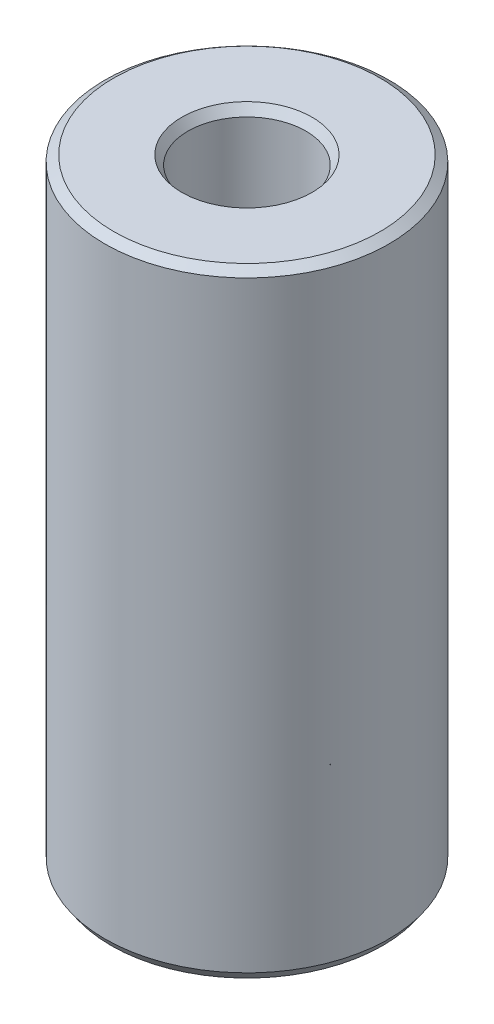
ISO-10303-21;
HEADER;
FILE_DESCRIPTION(('STEP AP214'),'2;1');
FILE_NAME('part.step','',(''),(''),'','','');
FILE_SCHEMA(('AUTOMOTIVE_DESIGN { 1 0 10303 214 1 1 1 1 }'));
ENDSEC;
DATA;
#1=APPLICATION_CONTEXT('core data for automotive mechanical design processes');
#2=APPLICATION_PROTOCOL_DEFINITION('international standard','automotive_design',2000,#1);
#3=PRODUCT_CONTEXT('',#1,'mechanical');
#4=PRODUCT('Part','Part','',(#3));
#5=PRODUCT_RELATED_PRODUCT_CATEGORY('part','',(#4));
#6=PRODUCT_DEFINITION_FORMATION('','',#4);
#7=PRODUCT_DEFINITION_CONTEXT('part definition',#1,'design');
#8=PRODUCT_DEFINITION('design','',#6,#7);
#9=PRODUCT_DEFINITION_SHAPE('','',#8);
#10=(LENGTH_UNIT() NAMED_UNIT(*) SI_UNIT(.MILLI.,.METRE.));
#11=(NAMED_UNIT(*) PLANE_ANGLE_UNIT() SI_UNIT($,.RADIAN.));
#12=(NAMED_UNIT(*) SI_UNIT($,.STERADIAN.) SOLID_ANGLE_UNIT());
#13=UNCERTAINTY_MEASURE_WITH_UNIT(LENGTH_MEASURE(1.E-05),#10,'distance_accuracy_value','');
#14=(GEOMETRIC_REPRESENTATION_CONTEXT(3) GLOBAL_UNCERTAINTY_ASSIGNED_CONTEXT((#13)) GLOBAL_UNIT_ASSIGNED_CONTEXT((#10,
#11,#12)) REPRESENTATION_CONTEXT('',''));
#15=CARTESIAN_POINT('',(0.,0.,0.));
#16=DIRECTION('',(0.,0.,1.));
#17=DIRECTION('',(1.,0.,0.));
#18=AXIS2_PLACEMENT_3D('',#15,#16,#17);
#19=CARTESIAN_POINT('',(0.,141.156435356315,0.));
#20=DIRECTION('',(0.,-1.,0.));
#21=DIRECTION('',(0.,0.,-1.));
#22=AXIS2_PLACEMENT_3D('',#19,#20,#21);
#23=CYLINDRICAL_SURFACE('',#22,32.5);
#24=CARTESIAN_POINT('',(0.,2.04049418436703,0.));
#25=DIRECTION('',(0.,1.,0.));
#26=DIRECTION('',(0.,0.,1.));
#27=AXIS2_PLACEMENT_3D('',#24,#25,#26);
#28=CIRCLE('',#27,32.5);
#29=CARTESIAN_POINT('',(0.,2.04049418436703,32.5));
#30=VERTEX_POINT('',#29);
#31=EDGE_CURVE('E10',#30,#30,#28,.T.);
#32=ORIENTED_EDGE('',*,*,#31,.T.);
#33=EDGE_LOOP('',(#32));
#34=FACE_BOUND('',#33,.T.);
#35=CARTESIAN_POINT('',(0.,139.734117660192,0.));
#36=DIRECTION('',(0.,1.,0.));
#37=DIRECTION('',(0.,0.,1.));
#38=AXIS2_PLACEMENT_3D('',#35,#36,#37);
#39=CIRCLE('',#38,32.5);
#40=CARTESIAN_POINT('',(0.,139.734117660192,32.5));
#41=VERTEX_POINT('',#40);
#42=EDGE_CURVE('E50',#41,#41,#39,.F.);
#43=ORIENTED_EDGE('',*,*,#42,.T.);
#44=EDGE_LOOP('',(#43));
#45=FACE_BOUND('',#44,.T.);
#46=ADVANCED_FACE('F39',(#34,#45),#23,.T.);
#47=CARTESIAN_POINT('',(0.,141.156435356315,0.));
#48=DIRECTION('',(0.,1.,0.));
#49=DIRECTION('',(0.,0.,1.));
#50=AXIS2_PLACEMENT_3D('',#47,#48,#49);
#51=PLANE('',#50);
#52=CARTESIAN_POINT('',(0.,141.156435356315,0.));
#53=DIRECTION('',(0.,1.,0.));
#54=DIRECTION('',(0.,0.,1.));
#55=AXIS2_PLACEMENT_3D('',#52,#53,#54);
#56=CIRCLE('',#55,14.9146712192503);
#57=CARTESIAN_POINT('',(0.,141.156435356315,14.9146712192503));
#58=VERTEX_POINT('',#57);
#59=EDGE_CURVE('E58',#58,#58,#56,.F.);
#60=ORIENTED_EDGE('',*,*,#59,.T.);
#61=EDGE_LOOP('',(#60));
#62=FACE_BOUND('',#61,.T.);
#63=CARTESIAN_POINT('',(0.,141.156435356315,0.));
#64=DIRECTION('',(0.,1.,0.));
#65=DIRECTION('',(0.,0.,1.));
#66=AXIS2_PLACEMENT_3D('',#63,#64,#65);
#67=CIRCLE('',#66,30.459505815633);
#68=CARTESIAN_POINT('',(0.,141.156435356315,30.459505815633));
#69=VERTEX_POINT('',#68);
#70=EDGE_CURVE('E61',#69,#69,#67,.T.);
#71=ORIENTED_EDGE('',*,*,#70,.T.);
#72=EDGE_LOOP('',(#71));
#73=FACE_BOUND('',#72,.T.);
#74=ADVANCED_FACE('F88',(#62,#73),#51,.T.);
#75=CARTESIAN_POINT('',(0.,0.,0.));
#76=DIRECTION('',(0.,1.,0.));
#77=DIRECTION('',(0.,0.,1.));
#78=AXIS2_PLACEMENT_3D('',#75,#76,#77);
#79=PLANE('',#78);
#80=CARTESIAN_POINT('',(0.,0.,0.));
#81=DIRECTION('',(0.,1.,0.));
#82=DIRECTION('',(0.,0.,1.));
#83=AXIS2_PLACEMENT_3D('',#80,#81,#82);
#84=CIRCLE('',#83,15.5328477074946);
#85=CARTESIAN_POINT('',(0.,0.,-15.5328477074946));
#86=VERTEX_POINT('',#85);
#87=EDGE_CURVE('E51',#86,#86,#84,.T.);
#88=ORIENTED_EDGE('',*,*,#87,.T.);
#89=EDGE_LOOP('',(#88));
#90=FACE_BOUND('',#89,.T.);
#91=CARTESIAN_POINT('',(0.,0.,0.));
#92=DIRECTION('',(0.,1.,0.));
#93=DIRECTION('',(0.,0.,1.));
#94=AXIS2_PLACEMENT_3D('',#91,#92,#93);
#95=CIRCLE('',#94,31.0776823038773);
#96=CARTESIAN_POINT('',(0.,0.,31.0776823038773));
#97=VERTEX_POINT('',#96);
#98=EDGE_CURVE('E54',#97,#97,#95,.F.);
#99=ORIENTED_EDGE('',*,*,#98,.T.);
#100=EDGE_LOOP('',(#99));
#101=FACE_BOUND('',#100,.T.);
#102=ADVANCED_FACE('F83',(#90,#101),#79,.F.);
#103=CARTESIAN_POINT('',(0.,141.156435356315,0.));
#104=DIRECTION('',(0.,-1.,0.));
#105=DIRECTION('',(0.,0.,-1.));
#106=AXIS2_PLACEMENT_3D('',#103,#104,#105);
#107=CYLINDRICAL_SURFACE('',#106,13.4923535231276);
#108=CARTESIAN_POINT('',(0.,139.115941171948,0.));
#109=DIRECTION('',(0.,1.,0.));
#110=DIRECTION('',(0.,0.,1.));
#111=AXIS2_PLACEMENT_3D('',#108,#109,#110);
#112=CIRCLE('',#111,13.4923535231276);
#113=CARTESIAN_POINT('',(0.,139.115941171948,13.4923535231276));
#114=VERTEX_POINT('',#113);
#115=EDGE_CURVE('E67',#114,#114,#112,.T.);
#116=ORIENTED_EDGE('',*,*,#115,.T.);
#117=EDGE_LOOP('',(#116));
#118=FACE_BOUND('',#117,.T.);
#119=CARTESIAN_POINT('',(0.,1.42231769612275,0.));
#120=DIRECTION('',(0.,1.,0.));
#121=DIRECTION('',(0.,0.,1.));
#122=AXIS2_PLACEMENT_3D('',#119,#120,#121);
#123=CIRCLE('',#122,13.4923535231276);
#124=CARTESIAN_POINT('',(0.,1.42231769612275,-13.4923535231276));
#125=VERTEX_POINT('',#124);
#126=EDGE_CURVE('E69',#125,#125,#123,.F.);
#127=ORIENTED_EDGE('',*,*,#126,.T.);
#128=EDGE_LOOP('',(#127));
#129=FACE_BOUND('',#128,.T.);
#130=ADVANCED_FACE('F71',(#118,#129),#107,.F.);
#131=CARTESIAN_POINT('',(0.,139.115941171948,0.));
#132=DIRECTION('',(0.,1.,0.));
#133=DIRECTION('',(0.,0.,1.));
#134=AXIS2_PLACEMENT_3D('',#131,#132,#133);
#135=CONICAL_SURFACE('',#134,13.4923535231276,0.608740459264375);
#136=ORIENTED_EDGE('',*,*,#59,.F.);
#137=EDGE_LOOP('',(#136));
#138=FACE_BOUND('',#137,.T.);
#139=ORIENTED_EDGE('',*,*,#115,.F.);
#140=EDGE_LOOP('',(#139));
#141=FACE_BOUND('',#140,.T.);
#142=ADVANCED_FACE('F77',(#138,#141),#135,.F.);
#143=CARTESIAN_POINT('',(0.,0.,0.));
#144=DIRECTION('',(0.,-1.,0.));
#145=DIRECTION('',(0.,0.,-1.));
#146=AXIS2_PLACEMENT_3D('',#143,#144,#145);
#147=CONICAL_SURFACE('',#146,15.5328477074946,0.962055867530516);
#148=CARTESIAN_POINT('',(0.,1.42231769612275,-13.4923535231276));
#149=CARTESIAN_POINT('',(0.,1.40750188678814,-13.5136086708814));
#150=CARTESIAN_POINT('',(0.,1.39268607745353,-13.5348638186352));
#151=CARTESIAN_POINT('',(0.,1.3630544587843,-13.5773741141429));
#152=CARTESIAN_POINT('',(0.,1.34823864944969,-13.5986292618967));
#153=CARTESIAN_POINT('',(0.,1.31860703078046,-13.6411395574043));
#154=CARTESIAN_POINT('',(0.,1.30379122144585,-13.6623947051582));
#155=CARTESIAN_POINT('',(0.,1.27415960277663,-13.7049050006658));
#156=CARTESIAN_POINT('',(0.,1.25934379344202,-13.7261601484196));
#157=CARTESIAN_POINT('',(0.,1.22971217477279,-13.7686704439273));
#158=CARTESIAN_POINT('',(0.,1.21489636543818,-13.7899255916811));
#159=CARTESIAN_POINT('',(0.,1.18526474676896,-13.8324358871887));
#160=CARTESIAN_POINT('',(0.,1.17044893743435,-13.8536910349426));
#161=CARTESIAN_POINT('',(0.,1.14081731876512,-13.8962013304502));
#162=CARTESIAN_POINT('',(0.,1.12600150943051,-13.917456478204));
#163=CARTESIAN_POINT('',(0.,1.09636989076129,-13.9599667737117));
#164=CARTESIAN_POINT('',(0.,1.08155408142667,-13.9812219214655));
#165=CARTESIAN_POINT('',(0.,1.05192246275745,-14.0237322169731));
#166=CARTESIAN_POINT('',(0.,1.03710665342284,-14.044987364727));
#167=CARTESIAN_POINT('',(0.,1.00747503475361,-14.0874976602346));
#168=CARTESIAN_POINT('',(0.,0.992659225419002,-14.1087528079884));
#169=CARTESIAN_POINT('',(0.,0.963027606749778,-14.1512631034961));
#170=CARTESIAN_POINT('',(0.,0.948211797415166,-14.1725182512499));
#171=CARTESIAN_POINT('',(0.,0.918580178745942,-14.2150285467576));
#172=CARTESIAN_POINT('',(0.,0.90376436941133,-14.2362836945114));
#173=CARTESIAN_POINT('',(0.,0.874132750742106,-14.278793990019));
#174=CARTESIAN_POINT('',(0.,0.859316941407494,-14.3000491377728));
#175=CARTESIAN_POINT('',(0.,0.82968532273827,-14.3425594332805));
#176=CARTESIAN_POINT('',(0.,0.814869513403658,-14.3638145810343));
#177=CARTESIAN_POINT('',(0.,0.785237894734434,-14.406324876542));
#178=CARTESIAN_POINT('',(0.,0.770422085399822,-14.4275800242958));
#179=CARTESIAN_POINT('',(0.,0.740790466730598,-14.4700903198034));
#180=CARTESIAN_POINT('',(0.,0.725974657395986,-14.4913454675573));
#181=CARTESIAN_POINT('',(0.,0.696343038726762,-14.5338557630649));
#182=CARTESIAN_POINT('',(0.,0.681527229392151,-14.5551109108187));
#183=CARTESIAN_POINT('',(0.,0.651895610722927,-14.5976212063264));
#184=CARTESIAN_POINT('',(0.,0.637079801388314,-14.6188763540802));
#185=CARTESIAN_POINT('',(0.,0.60744818271909,-14.6613866495878));
#186=CARTESIAN_POINT('',(0.,0.592632373384479,-14.6826417973417));
#187=CARTESIAN_POINT('',(0.,0.563000754715255,-14.7251520928493));
#188=CARTESIAN_POINT('',(0.,0.548184945380643,-14.7464072406031));
#189=CARTESIAN_POINT('',(0.,0.518553326711419,-14.7889175361108));
#190=CARTESIAN_POINT('',(0.,0.503737517376807,-14.8101726838646));
#191=CARTESIAN_POINT('',(0.,0.474105898707583,-14.8526829793722));
#192=CARTESIAN_POINT('',(0.,0.459290089372971,-14.8739381271261));
#193=CARTESIAN_POINT('',(0.,0.429658470703747,-14.9164484226337));
#194=CARTESIAN_POINT('',(0.,0.414842661369135,-14.9377035703875));
#195=CARTESIAN_POINT('',(0.,0.385211042699911,-14.9802138658952));
#196=CARTESIAN_POINT('',(0.,0.370395233365299,-15.001469013649));
#197=CARTESIAN_POINT('',(0.,0.340763614696075,-15.0439793091566));
#198=CARTESIAN_POINT('',(0.,0.325947805361463,-15.0652344569105));
#199=CARTESIAN_POINT('',(0.,0.296316186692239,-15.1077447524181));
#200=CARTESIAN_POINT('',(0.,0.281500377357627,-15.1289999001719));
#201=CARTESIAN_POINT('',(0.,0.251868758688403,-15.1715101956796));
#202=CARTESIAN_POINT('',(0.,0.237052949353791,-15.1927653434334));
#203=CARTESIAN_POINT('',(0.,0.207421330684568,-15.2352756389411));
#204=CARTESIAN_POINT('',(0.,0.192605521349956,-15.2565307866949));
#205=CARTESIAN_POINT('',(0.,0.162973902680732,-15.2990410822025));
#206=CARTESIAN_POINT('',(0.,0.14815809334612,-15.3202962299563));
#207=CARTESIAN_POINT('',(0.,0.118526474676896,-15.362806525464));
#208=CARTESIAN_POINT('',(0.,0.103710665342284,-15.3840616732178));
#209=CARTESIAN_POINT('',(0.,0.07407904667306,-15.4265719687255));
#210=CARTESIAN_POINT('',(0.,0.0592632373384479,-15.4478271164793));
#211=CARTESIAN_POINT('',(0.,0.0296316186692236,-15.4903374119869));
#212=CARTESIAN_POINT('',(0.,0.0148158093346115,-15.5115925597408));
#213=CARTESIAN_POINT('',(0.,0.,-15.5328477074946));
#214=B_SPLINE_CURVE_WITH_KNOTS('',3,(#148,#149,#150,#151,#152,#153,#154,#155,#156,#157,#158,
#159,#160,#161,#162,#163,#164,#165,#166,#167,#168,#169,#170,#171,#172,#173,#174,#175,#176,#177,
#178,#179,#180,#181,#182,#183,#184,#185,#186,#187,#188,#189,#190,#191,#192,#193,#194,#195,#196,
#197,#198,#199,#200,#201,#202,#203,#204,#205,#206,#207,#208,#209,#210,#211,#212,#213),
.UNSPECIFIED.,.F.,.F.,(4,2,2,2,2,2,2,2,2,2,2,2,2,2,2,2,2,2,2,2,2,2,2,2,2,2,2,2,2,2,2,2,4),(0.,
0.0777277660201801,0.155455532040359,0.233183298060539,0.310911064080719,0.388638830100898,
0.466366596121078,0.544094362141257,0.621822128161437,0.699549894181617,0.777277660201796,
0.855005426221976,0.932733192242156,1.01046095826233,1.08818872428251,1.16591649030269,
1.24364425632287,1.32137202234305,1.39909978836323,1.47682755438341,1.55455532040359,
1.63228308642377,1.71001085244395,1.78773861846413,1.86546638448431,1.94319415050449,
2.02092191652467,2.09864968254485,2.17637744856503,2.25410521458521,2.33183298060539,
2.40956074662557,2.48728851264575),.UNSPECIFIED.);
#215=EDGE_CURVE('BSEAM73',#125,#86,#214,.T.);
#216=ORIENTED_EDGE('',*,*,#126,.F.);
#217=ORIENTED_EDGE('',*,*,#87,.F.);
#218=ORIENTED_EDGE('',*,*,#215,.T.);
#219=ORIENTED_EDGE('',*,*,#215,.F.);
#220=EDGE_LOOP('',(#216,#218,#217,#219));
#221=FACE_BOUND('',#220,.T.);
#222=ADVANCED_FACE('F73',(#221),#147,.F.);
#223=CARTESIAN_POINT('',(0.,2.04049418436703,0.));
#224=DIRECTION('',(0.,1.,0.));
#225=DIRECTION('',(0.,0.,1.));
#226=AXIS2_PLACEMENT_3D('',#223,#224,#225);
#227=CONICAL_SURFACE('',#226,32.5,0.608740459264372);
#228=ORIENTED_EDGE('',*,*,#98,.F.);
#229=EDGE_LOOP('',(#228));
#230=FACE_BOUND('',#229,.T.);
#231=ORIENTED_EDGE('',*,*,#31,.F.);
#232=EDGE_LOOP('',(#231));
#233=FACE_BOUND('',#232,.T.);
#234=ADVANCED_FACE('F76',(#230,#233),#227,.T.);
#235=CARTESIAN_POINT('',(0.,141.156435356315,0.));
#236=DIRECTION('',(0.,-1.,0.));
#237=DIRECTION('',(0.,0.,-1.));
#238=AXIS2_PLACEMENT_3D('',#235,#236,#237);
#239=CONICAL_SURFACE('',#238,30.459505815633,0.962055867530511);
#240=ORIENTED_EDGE('',*,*,#42,.F.);
#241=EDGE_LOOP('',(#240));
#242=FACE_BOUND('',#241,.T.);
#243=ORIENTED_EDGE('',*,*,#70,.F.);
#244=EDGE_LOOP('',(#243));
#245=FACE_BOUND('',#244,.T.);
#246=ADVANCED_FACE('F45',(#242,#245),#239,.T.);
#247=CLOSED_SHELL('',(#46,#74,#102,#130,#142,#222,#234,#246));
#248=MANIFOLD_SOLID_BREP('B2',#247);
#249=ADVANCED_BREP_SHAPE_REPRESENTATION('',(#18,#248),#14);
#250=SHAPE_DEFINITION_REPRESENTATION(#9,#249);
ENDSEC;
END-ISO-10303-21;
